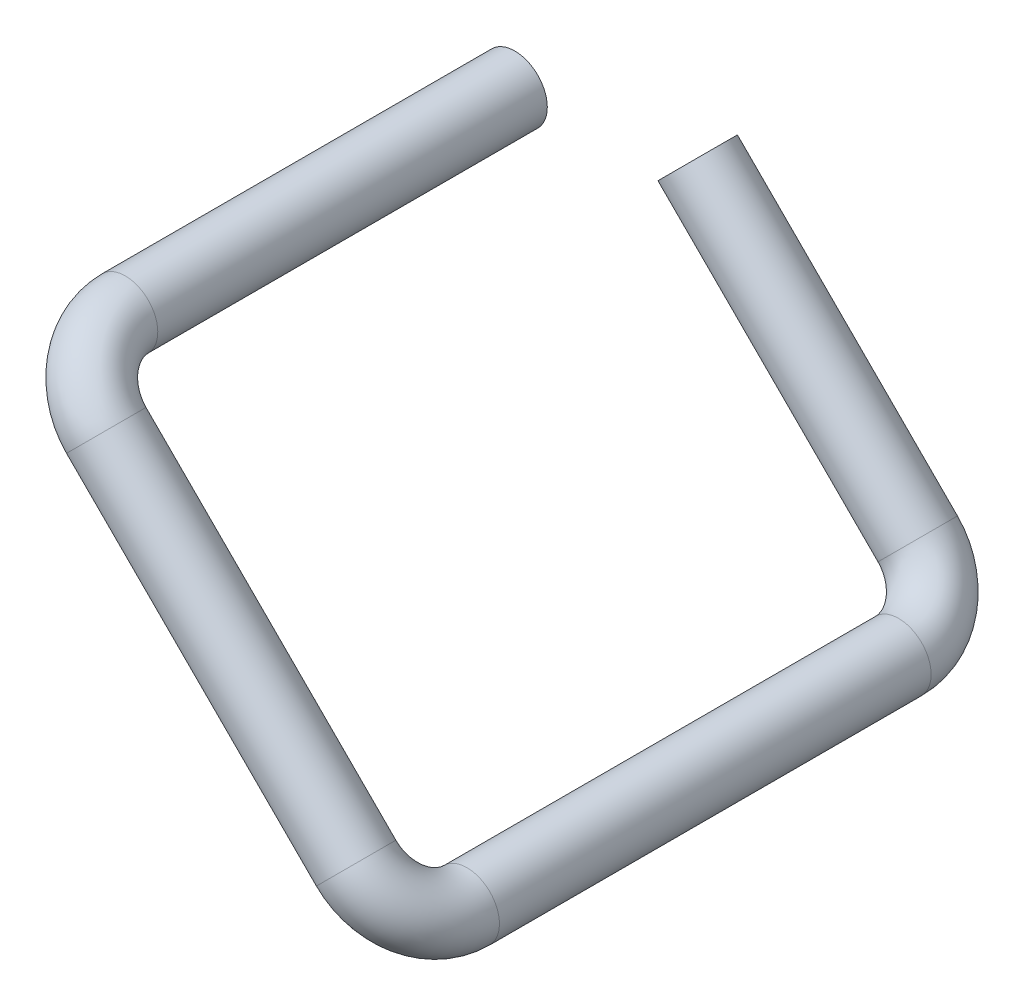
ISO-10303-21;
HEADER;
FILE_DESCRIPTION(('STEP AP214'),'2;1');
FILE_NAME('part.step','',(''),(''),'','','');
FILE_SCHEMA(('AUTOMOTIVE_DESIGN { 1 0 10303 214 1 1 1 1 }'));
ENDSEC;
DATA;
#1=APPLICATION_CONTEXT('core data for automotive mechanical design processes');
#2=APPLICATION_PROTOCOL_DEFINITION('international standard','automotive_design',2000,#1);
#3=PRODUCT_CONTEXT('',#1,'mechanical');
#4=PRODUCT('Part','Part','',(#3));
#5=PRODUCT_RELATED_PRODUCT_CATEGORY('part','',(#4));
#6=PRODUCT_DEFINITION_FORMATION('','',#4);
#7=PRODUCT_DEFINITION_CONTEXT('part definition',#1,'design');
#8=PRODUCT_DEFINITION('design','',#6,#7);
#9=PRODUCT_DEFINITION_SHAPE('','',#8);
#10=(LENGTH_UNIT() NAMED_UNIT(*) SI_UNIT(.MILLI.,.METRE.));
#11=(NAMED_UNIT(*) PLANE_ANGLE_UNIT() SI_UNIT($,.RADIAN.));
#12=(NAMED_UNIT(*) SI_UNIT($,.STERADIAN.) SOLID_ANGLE_UNIT());
#13=UNCERTAINTY_MEASURE_WITH_UNIT(LENGTH_MEASURE(1.E-05),#10,'distance_accuracy_value','');
#14=(GEOMETRIC_REPRESENTATION_CONTEXT(3) GLOBAL_UNCERTAINTY_ASSIGNED_CONTEXT((#13)) GLOBAL_UNIT_ASSIGNED_CONTEXT((#10,
#11,#12)) REPRESENTATION_CONTEXT('',''));
#15=CARTESIAN_POINT('',(0.,0.,0.));
#16=DIRECTION('',(0.,0.,1.));
#17=DIRECTION('',(1.,0.,0.));
#18=AXIS2_PLACEMENT_3D('',#15,#16,#17);
#19=CARTESIAN_POINT('',(57.8581111949689,-57.8581111949689,-20.9499000000002));
#20=DIRECTION('',(-0.707106781186547,0.707106781186548,0.));
#21=DIRECTION('',(-0.707106781186548,-0.707106781186547,0.));
#22=AXIS2_PLACEMENT_3D('',#19,#20,#21);
#23=CYLINDRICAL_SURFACE('',#22,6.35);
#24=CARTESIAN_POINT('',(57.8581111949689,-57.8581111949689,-20.9499000000002));
#25=DIRECTION('',(-0.707106781186548,0.707106781186547,0.));
#26=DIRECTION('',(0.5,0.500000000000001,0.707106781186547));
#27=AXIS2_PLACEMENT_3D('',#24,#25,#26);
#28=CIRCLE('',#27,6.35);
#29=CARTESIAN_POINT('',(57.8581111949689,-57.8581111949689,-27.2999000000002));
#30=VERTEX_POINT('',#29);
#31=EDGE_CURVE('E37',#30,#30,#28,.T.);
#32=ORIENTED_EDGE('',*,*,#31,.T.);
#33=EDGE_LOOP('',(#32));
#34=FACE_BOUND('',#33,.T.);
#35=CARTESIAN_POINT('',(14.8138163551801,-14.8138163551801,-20.9499000000001));
#36=DIRECTION('',(-0.707106781186548,0.707106781186547,0.));
#37=DIRECTION('',(0.5,0.500000000000001,0.707106781186547));
#38=AXIS2_PLACEMENT_3D('',#35,#36,#37);
#39=CIRCLE('',#38,6.35);
#40=CARTESIAN_POINT('',(17.9888163551801,-11.6388163551801,-16.4597719394655));
#41=VERTEX_POINT('',#40);
#42=EDGE_CURVE('E10',#41,#41,#39,.T.);
#43=ORIENTED_EDGE('',*,*,#42,.F.);
#44=EDGE_LOOP('',(#43));
#45=FACE_BOUND('',#44,.T.);
#46=ADVANCED_FACE('F31',(#34,#45),#23,.T.);
#47=CARTESIAN_POINT('',(57.8581111949689,-57.858111194969,-8.24990000000012));
#48=DIRECTION('',(0.707106781186547,0.707106781186548,0.));
#49=DIRECTION('',(-0.707106781186548,0.707106781186547,0.));
#50=AXIS2_PLACEMENT_3D('',#47,#48,#49);
#51=TOROIDAL_SURFACE('',#50,12.7000000000001,6.35);
#52=CARTESIAN_POINT('',(66.8383673160381,-66.8383673160382,-8.24990000000012));
#53=DIRECTION('',(0.,0.,-1.));
#54=DIRECTION('',(0.,1.,0.));
#55=AXIS2_PLACEMENT_3D('',#52,#53,#54);
#56=CIRCLE('',#55,6.35);
#57=CARTESIAN_POINT('',(71.3284953765727,-71.3284953765728,-8.24990000000012));
#58=VERTEX_POINT('',#57);
#59=EDGE_CURVE('E41',#58,#58,#56,.T.);
#60=CARTESIAN_POINT('',(57.8581111949689,-57.858111194969,-8.24990000000012));
#61=DIRECTION('',(0.707106781186547,0.707106781186548,0.));
#62=DIRECTION('',(-0.707106781186548,0.707106781186547,0.));
#63=AXIS2_PLACEMENT_3D('',#60,#61,#62);
#64=CIRCLE('',#63,19.0500000000001);
#65=EDGE_CURVE('',#58,#30,#64,.T.);
#66=ORIENTED_EDGE('',*,*,#59,.T.);
#67=ORIENTED_EDGE('',*,*,#31,.F.);
#68=ORIENTED_EDGE('',*,*,#65,.T.);
#69=ORIENTED_EDGE('',*,*,#65,.F.);
#70=EDGE_LOOP('',(#66,#68,#67,#69));
#71=FACE_BOUND('',#70,.T.);
#72=ADVANCED_FACE('F111',(#71),#51,.T.);
#73=CARTESIAN_POINT('',(66.8383673160381,-66.8383673160381,76.2003575474502));
#74=DIRECTION('',(0.,0.,-1.));
#75=DIRECTION('',(0.,1.,0.));
#76=AXIS2_PLACEMENT_3D('',#73,#74,#75);
#77=CYLINDRICAL_SURFACE('',#76,6.35);
#78=CARTESIAN_POINT('',(66.8383673160381,-66.8383673160381,76.2003575474502));
#79=DIRECTION('',(0.,0.,-1.));
#80=DIRECTION('',(0.,1.,0.));
#81=AXIS2_PLACEMENT_3D('',#78,#79,#80);
#82=CIRCLE('',#81,6.35);
#83=CARTESIAN_POINT('',(71.3284953765727,-71.3284953765727,76.2003575474502));
#84=VERTEX_POINT('',#83);
#85=EDGE_CURVE('E45',#84,#84,#82,.T.);
#86=ORIENTED_EDGE('',*,*,#85,.T.);
#87=EDGE_LOOP('',(#86));
#88=FACE_BOUND('',#87,.T.);
#89=ORIENTED_EDGE('',*,*,#59,.F.);
#90=EDGE_LOOP('',(#89));
#91=FACE_BOUND('',#90,.T.);
#92=ADVANCED_FACE('F115',(#88,#91),#77,.T.);
#93=CARTESIAN_POINT('',(57.8581111949689,-57.8581111949689,76.2003575474502));
#94=DIRECTION('',(0.707106781186548,0.707106781186548,0.));
#95=DIRECTION('',(-0.707106781186548,0.707106781186548,0.));
#96=AXIS2_PLACEMENT_3D('',#93,#94,#95);
#97=TOROIDAL_SURFACE('',#96,12.7000000000001,6.35);
#98=CARTESIAN_POINT('',(57.8581111949689,-57.8581111949689,88.9003575474503));
#99=DIRECTION('',(0.707106781186548,-0.707106781186547,0.));
#100=DIRECTION('',(0.500000000000002,0.499999999999998,-0.707106781186548));
#101=AXIS2_PLACEMENT_3D('',#98,#99,#100);
#102=CIRCLE('',#101,6.35);
#103=CARTESIAN_POINT('',(57.8581111949689,-57.8581111949689,95.2503575474503));
#104=VERTEX_POINT('',#103);
#105=EDGE_CURVE('E50',#104,#104,#102,.T.);
#106=CARTESIAN_POINT('',(57.8581111949689,-57.8581111949689,76.2003575474502));
#107=DIRECTION('',(0.707106781186548,0.707106781186548,0.));
#108=DIRECTION('',(-0.707106781186548,0.707106781186548,0.));
#109=AXIS2_PLACEMENT_3D('',#106,#107,#108);
#110=CIRCLE('',#109,19.0500000000001);
#111=EDGE_CURVE('',#104,#84,#110,.T.);
#112=ORIENTED_EDGE('',*,*,#105,.T.);
#113=ORIENTED_EDGE('',*,*,#85,.F.);
#114=ORIENTED_EDGE('',*,*,#111,.T.);
#115=ORIENTED_EDGE('',*,*,#111,.F.);
#116=EDGE_LOOP('',(#112,#114,#113,#115));
#117=FACE_BOUND('',#116,.T.);
#118=ADVANCED_FACE('F121',(#117),#97,.T.);
#119=CARTESIAN_POINT('',(8.98025612106921,-8.98025612106922,88.9003575474504));
#120=DIRECTION('',(0.707106781186547,-0.707106781186548,0.));
#121=DIRECTION('',(0.707106781186548,0.707106781186547,0.));
#122=AXIS2_PLACEMENT_3D('',#119,#120,#121);
#123=CYLINDRICAL_SURFACE('',#122,6.35);
#124=CARTESIAN_POINT('',(8.98025612106921,-8.98025612106922,88.9003575474504));
#125=DIRECTION('',(0.707106781186548,-0.707106781186547,0.));
#126=DIRECTION('',(0.500000000000002,0.499999999999998,-0.707106781186548));
#127=AXIS2_PLACEMENT_3D('',#124,#125,#126);
#128=CIRCLE('',#127,6.35);
#129=CARTESIAN_POINT('',(8.98025612106921,-8.98025612106922,95.2503575474504));
#130=VERTEX_POINT('',#129);
#131=EDGE_CURVE('E53',#130,#130,#128,.T.);
#132=ORIENTED_EDGE('',*,*,#131,.T.);
#133=EDGE_LOOP('',(#132));
#134=FACE_BOUND('',#133,.T.);
#135=ORIENTED_EDGE('',*,*,#105,.F.);
#136=EDGE_LOOP('',(#135));
#137=FACE_BOUND('',#136,.T.);
#138=ADVANCED_FACE('F128',(#134,#137),#123,.T.);
#139=CARTESIAN_POINT('',(8.9802561210692,-8.98025612106923,76.2003575474504));
#140=DIRECTION('',(0.707106781186547,0.707106781186548,0.));
#141=DIRECTION('',(-0.707106781186548,0.707106781186547,0.));
#142=AXIS2_PLACEMENT_3D('',#139,#140,#141);
#143=TOROIDAL_SURFACE('',#142,12.7000000000001,6.35);
#144=CARTESIAN_POINT('',(0.,0.,76.2003575474504));
#145=DIRECTION('',(0.,0.,1.));
#146=DIRECTION('',(1.,0.,0.));
#147=AXIS2_PLACEMENT_3D('',#144,#145,#146);
#148=CIRCLE('',#147,6.35);
#149=CARTESIAN_POINT('',(-4.49012806053458,4.49012806053455,76.2003575474504));
#150=VERTEX_POINT('',#149);
#151=EDGE_CURVE('E56',#150,#150,#148,.T.);
#152=CARTESIAN_POINT('',(8.9802561210692,-8.98025612106923,76.2003575474504));
#153=DIRECTION('',(0.707106781186547,0.707106781186548,0.));
#154=DIRECTION('',(-0.707106781186548,0.707106781186547,0.));
#155=AXIS2_PLACEMENT_3D('',#152,#153,#154);
#156=CIRCLE('',#155,19.0500000000001);
#157=EDGE_CURVE('',#150,#130,#156,.T.);
#158=ORIENTED_EDGE('',*,*,#151,.T.);
#159=ORIENTED_EDGE('',*,*,#131,.F.);
#160=ORIENTED_EDGE('',*,*,#157,.T.);
#161=ORIENTED_EDGE('',*,*,#157,.F.);
#162=EDGE_LOOP('',(#158,#160,#159,#161));
#163=FACE_BOUND('',#162,.T.);
#164=ADVANCED_FACE('F106',(#163),#143,.T.);
#165=CARTESIAN_POINT('',(0.,0.,76.2003575474504));
#166=DIRECTION('',(0.,0.,-1.));
#167=DIRECTION('',(0.,1.,0.));
#168=AXIS2_PLACEMENT_3D('',#165,#166,#167);
#169=CYLINDRICAL_SURFACE('',#168,6.35);
#170=ORIENTED_EDGE('',*,*,#151,.F.);
#171=EDGE_LOOP('',(#170));
#172=FACE_BOUND('',#171,.T.);
#173=CARTESIAN_POINT('',(0.,0.,0.));
#174=DIRECTION('',(0.,0.,1.));
#175=DIRECTION('',(1.,0.,0.));
#176=AXIS2_PLACEMENT_3D('',#173,#174,#175);
#177=CIRCLE('',#176,6.35);
#178=CARTESIAN_POINT('',(6.35,0.,0.));
#179=VERTEX_POINT('',#178);
#180=EDGE_CURVE('E57',#179,#179,#177,.T.);
#181=ORIENTED_EDGE('',*,*,#180,.T.);
#182=EDGE_LOOP('',(#181));
#183=FACE_BOUND('',#182,.T.);
#184=ADVANCED_FACE('F98',(#172,#183),#169,.T.);
#185=CARTESIAN_POINT('',(14.8138163551801,-14.8138163551801,-20.9499000000001));
#186=DIRECTION('',(-0.707106781186548,0.707106781186547,0.));
#187=DIRECTION('',(0.5,0.500000000000001,0.707106781186547));
#188=AXIS2_PLACEMENT_3D('',#185,#186,#187);
#189=PLANE('',#188);
#190=CARTESIAN_POINT('',(14.8138163551801,-14.8138163551801,-20.9499000000001));
#191=DIRECTION('',(-0.707106781186548,0.707106781186547,0.));
#192=DIRECTION('',(-0.707106781186547,-0.707106781186548,0.));
#193=AXIS2_PLACEMENT_3D('',#190,#191,#192);
#194=CIRCLE('',#193,5.842);
#195=CARTESIAN_POINT('',(10.6828985394883,-18.9447341708719,-20.9499000000001));
#196=VERTEX_POINT('',#195);
#197=EDGE_CURVE('E60',#196,#196,#194,.T.);
#198=ORIENTED_EDGE('',*,*,#197,.F.);
#199=EDGE_LOOP('',(#198));
#200=FACE_BOUND('',#199,.T.);
#201=ORIENTED_EDGE('',*,*,#42,.T.);
#202=EDGE_LOOP('',(#201));
#203=FACE_BOUND('',#202,.T.);
#204=ADVANCED_FACE('F96',(#200,#203),#189,.T.);
#205=CARTESIAN_POINT('',(0.,0.,0.));
#206=DIRECTION('',(0.,0.,1.));
#207=DIRECTION('',(1.,0.,0.));
#208=AXIS2_PLACEMENT_3D('',#205,#206,#207);
#209=PLANE('',#208);
#210=CARTESIAN_POINT('',(0.,0.,0.));
#211=DIRECTION('',(0.,0.,1.));
#212=DIRECTION('',(1.,0.,0.));
#213=AXIS2_PLACEMENT_3D('',#210,#211,#212);
#214=CIRCLE('',#213,5.842);
#215=CARTESIAN_POINT('',(5.842,0.,0.));
#216=VERTEX_POINT('',#215);
#217=EDGE_CURVE('E63',#216,#216,#214,.T.);
#218=ORIENTED_EDGE('',*,*,#217,.T.);
#219=EDGE_LOOP('',(#218));
#220=FACE_BOUND('',#219,.T.);
#221=ORIENTED_EDGE('',*,*,#180,.F.);
#222=EDGE_LOOP('',(#221));
#223=FACE_BOUND('',#222,.T.);
#224=ADVANCED_FACE('F92',(#220,#223),#209,.F.);
#225=CARTESIAN_POINT('',(57.8581111949689,-57.8581111949689,-20.9499000000002));
#226=DIRECTION('',(-0.707106781186547,0.707106781186548,0.));
#227=DIRECTION('',(-0.707106781186548,-0.707106781186547,0.));
#228=AXIS2_PLACEMENT_3D('',#225,#226,#227);
#229=CYLINDRICAL_SURFACE('',#228,5.842);
#230=CARTESIAN_POINT('',(57.8581111949689,-57.8581111949689,-20.9499000000002));
#231=DIRECTION('',(-0.707106781186547,0.707106781186548,0.));
#232=DIRECTION('',(-0.707106781186548,-0.707106781186547,0.));
#233=AXIS2_PLACEMENT_3D('',#230,#231,#232);
#234=CIRCLE('',#233,5.842);
#235=CARTESIAN_POINT('',(57.8581111949689,-57.8581111949689,-26.7919000000002));
#236=VERTEX_POINT('',#235);
#237=EDGE_CURVE('E69',#236,#236,#234,.T.);
#238=ORIENTED_EDGE('',*,*,#237,.F.);
#239=EDGE_LOOP('',(#238));
#240=FACE_BOUND('',#239,.T.);
#241=ORIENTED_EDGE('',*,*,#197,.T.);
#242=EDGE_LOOP('',(#241));
#243=FACE_BOUND('',#242,.T.);
#244=ADVANCED_FACE('F89',(#240,#243),#229,.F.);
#245=CARTESIAN_POINT('',(57.8581111949689,-57.858111194969,-8.24990000000012));
#246=DIRECTION('',(0.707106781186547,0.707106781186548,0.));
#247=DIRECTION('',(-0.707106781186548,0.707106781186547,0.));
#248=AXIS2_PLACEMENT_3D('',#245,#246,#247);
#249=TOROIDAL_SURFACE('',#248,12.7000000000001,5.842);
#250=CARTESIAN_POINT('',(66.8383673160381,-66.8383673160382,-8.2499000000001));
#251=DIRECTION('',(0.,0.,1.));
#252=DIRECTION('',(1.,0.,0.));
#253=AXIS2_PLACEMENT_3D('',#250,#251,#252);
#254=CIRCLE('',#253,5.842);
#255=CARTESIAN_POINT('',(70.9692851317299,-70.96928513173,-8.2499000000001));
#256=VERTEX_POINT('',#255);
#257=EDGE_CURVE('E81',#256,#256,#254,.F.);
#258=CARTESIAN_POINT('',(57.8581111949689,-57.858111194969,-8.24990000000012));
#259=DIRECTION('',(0.707106781186547,0.707106781186548,0.));
#260=DIRECTION('',(-0.707106781186548,0.707106781186547,0.));
#261=AXIS2_PLACEMENT_3D('',#258,#259,#260);
#262=CIRCLE('',#261,18.5420000000001);
#263=EDGE_CURVE('',#256,#236,#262,.T.);
#264=ORIENTED_EDGE('',*,*,#257,.F.);
#265=ORIENTED_EDGE('',*,*,#237,.T.);
#266=ORIENTED_EDGE('',*,*,#263,.T.);
#267=ORIENTED_EDGE('',*,*,#263,.F.);
#268=EDGE_LOOP('',(#264,#266,#265,#267));
#269=FACE_BOUND('',#268,.T.);
#270=ADVANCED_FACE('F87',(#269),#249,.F.);
#271=CARTESIAN_POINT('',(66.8383673160381,-66.8383673160381,76.2003575474502));
#272=DIRECTION('',(0.,0.,-1.));
#273=DIRECTION('',(0.,1.,0.));
#274=AXIS2_PLACEMENT_3D('',#271,#272,#273);
#275=CYLINDRICAL_SURFACE('',#274,5.842);
#276=CARTESIAN_POINT('',(66.8383673160381,-66.8383673160381,76.2003575474502));
#277=DIRECTION('',(0.,0.,-1.));
#278=DIRECTION('',(0.,1.,0.));
#279=AXIS2_PLACEMENT_3D('',#276,#277,#278);
#280=CIRCLE('',#279,5.842);
#281=CARTESIAN_POINT('',(70.9692851317299,-70.9692851317299,76.2003575474502));
#282=VERTEX_POINT('',#281);
#283=EDGE_CURVE('E78',#282,#282,#280,.T.);
#284=ORIENTED_EDGE('',*,*,#283,.F.);
#285=EDGE_LOOP('',(#284));
#286=FACE_BOUND('',#285,.T.);
#287=ORIENTED_EDGE('',*,*,#257,.T.);
#288=EDGE_LOOP('',(#287));
#289=FACE_BOUND('',#288,.T.);
#290=ADVANCED_FACE('F180',(#286,#289),#275,.F.);
#291=CARTESIAN_POINT('',(57.8581111949689,-57.8581111949689,76.2003575474502));
#292=DIRECTION('',(0.707106781186548,0.707106781186548,0.));
#293=DIRECTION('',(-0.707106781186548,0.707106781186548,0.));
#294=AXIS2_PLACEMENT_3D('',#291,#292,#293);
#295=TOROIDAL_SURFACE('',#294,12.7000000000001,5.842);
#296=CARTESIAN_POINT('',(57.8581111949689,-57.8581111949689,88.9003575474503));
#297=DIRECTION('',(-0.707106781186548,0.707106781186548,0.));
#298=DIRECTION('',(-0.707106781186548,-0.707106781186548,0.));
#299=AXIS2_PLACEMENT_3D('',#296,#297,#298);
#300=CIRCLE('',#299,5.842);
#301=CARTESIAN_POINT('',(57.8581111949689,-57.8581111949689,94.7423575474503));
#302=VERTEX_POINT('',#301);
#303=EDGE_CURVE('E75',#302,#302,#300,.F.);
#304=CARTESIAN_POINT('',(57.8581111949689,-57.8581111949689,76.2003575474502));
#305=DIRECTION('',(0.707106781186548,0.707106781186548,0.));
#306=DIRECTION('',(-0.707106781186548,0.707106781186548,0.));
#307=AXIS2_PLACEMENT_3D('',#304,#305,#306);
#308=CIRCLE('',#307,18.5420000000001);
#309=EDGE_CURVE('',#302,#282,#308,.T.);
#310=ORIENTED_EDGE('',*,*,#303,.F.);
#311=ORIENTED_EDGE('',*,*,#283,.T.);
#312=ORIENTED_EDGE('',*,*,#309,.T.);
#313=ORIENTED_EDGE('',*,*,#309,.F.);
#314=EDGE_LOOP('',(#310,#312,#311,#313));
#315=FACE_BOUND('',#314,.T.);
#316=ADVANCED_FACE('F190',(#315),#295,.F.);
#317=CARTESIAN_POINT('',(8.98025612106921,-8.98025612106922,88.9003575474504));
#318=DIRECTION('',(0.707106781186547,-0.707106781186548,0.));
#319=DIRECTION('',(0.707106781186548,0.707106781186547,0.));
#320=AXIS2_PLACEMENT_3D('',#317,#318,#319);
#321=CYLINDRICAL_SURFACE('',#320,5.842);
#322=CARTESIAN_POINT('',(8.98025612106923,-8.98025612106924,88.9003575474504));
#323=DIRECTION('',(0.707106781186547,-0.707106781186548,0.));
#324=DIRECTION('',(0.707106781186548,0.707106781186547,0.));
#325=AXIS2_PLACEMENT_3D('',#322,#323,#324);
#326=CIRCLE('',#325,5.842);
#327=CARTESIAN_POINT('',(8.98025612106924,-8.98025612106925,94.7423575474504));
#328=VERTEX_POINT('',#327);
#329=EDGE_CURVE('E72',#328,#328,#326,.T.);
#330=ORIENTED_EDGE('',*,*,#329,.F.);
#331=EDGE_LOOP('',(#330));
#332=FACE_BOUND('',#331,.T.);
#333=ORIENTED_EDGE('',*,*,#303,.T.);
#334=EDGE_LOOP('',(#333));
#335=FACE_BOUND('',#334,.T.);
#336=ADVANCED_FACE('F200',(#332,#335),#321,.F.);
#337=CARTESIAN_POINT('',(8.9802561210692,-8.98025612106923,76.2003575474504));
#338=DIRECTION('',(0.707106781186547,0.707106781186548,0.));
#339=DIRECTION('',(-0.707106781186548,0.707106781186547,0.));
#340=AXIS2_PLACEMENT_3D('',#337,#338,#339);
#341=TOROIDAL_SURFACE('',#340,12.7000000000001,5.842);
#342=CARTESIAN_POINT('',(0.,0.,76.2003575474504));
#343=DIRECTION('',(0.,0.,-1.));
#344=DIRECTION('',(-1.,0.,0.));
#345=AXIS2_PLACEMENT_3D('',#342,#343,#344);
#346=CIRCLE('',#345,5.842);
#347=CARTESIAN_POINT('',(-4.13091781569181,4.13091781569178,76.2003575474504));
#348=VERTEX_POINT('',#347);
#349=EDGE_CURVE('E66',#348,#348,#346,.F.);
#350=CARTESIAN_POINT('',(8.9802561210692,-8.98025612106923,76.2003575474504));
#351=DIRECTION('',(0.707106781186547,0.707106781186548,0.));
#352=DIRECTION('',(-0.707106781186548,0.707106781186547,0.));
#353=AXIS2_PLACEMENT_3D('',#350,#351,#352);
#354=CIRCLE('',#353,18.5420000000001);
#355=EDGE_CURVE('',#348,#328,#354,.T.);
#356=ORIENTED_EDGE('',*,*,#349,.F.);
#357=ORIENTED_EDGE('',*,*,#329,.T.);
#358=ORIENTED_EDGE('',*,*,#355,.T.);
#359=ORIENTED_EDGE('',*,*,#355,.F.);
#360=EDGE_LOOP('',(#356,#358,#357,#359));
#361=FACE_BOUND('',#360,.T.);
#362=ADVANCED_FACE('F210',(#361),#341,.F.);
#363=CARTESIAN_POINT('',(0.,0.,76.2003575474504));
#364=DIRECTION('',(0.,0.,-1.));
#365=DIRECTION('',(0.,1.,0.));
#366=AXIS2_PLACEMENT_3D('',#363,#364,#365);
#367=CYLINDRICAL_SURFACE('',#366,5.842);
#368=ORIENTED_EDGE('',*,*,#349,.T.);
#369=EDGE_LOOP('',(#368));
#370=FACE_BOUND('',#369,.T.);
#371=ORIENTED_EDGE('',*,*,#217,.F.);
#372=EDGE_LOOP('',(#371));
#373=FACE_BOUND('',#372,.T.);
#374=ADVANCED_FACE('F220',(#370,#373),#367,.F.);
#375=CLOSED_SHELL('',(#46,#72,#92,#118,#138,#164,#184,#204,#224,#244,#270,#290,#316,#336,#362,#374));
#376=MANIFOLD_SOLID_BREP('B2',#375);
#377=ADVANCED_BREP_SHAPE_REPRESENTATION('',(#18,#376),#14);
#378=SHAPE_DEFINITION_REPRESENTATION(#9,#377);
ENDSEC;
END-ISO-10303-21;
